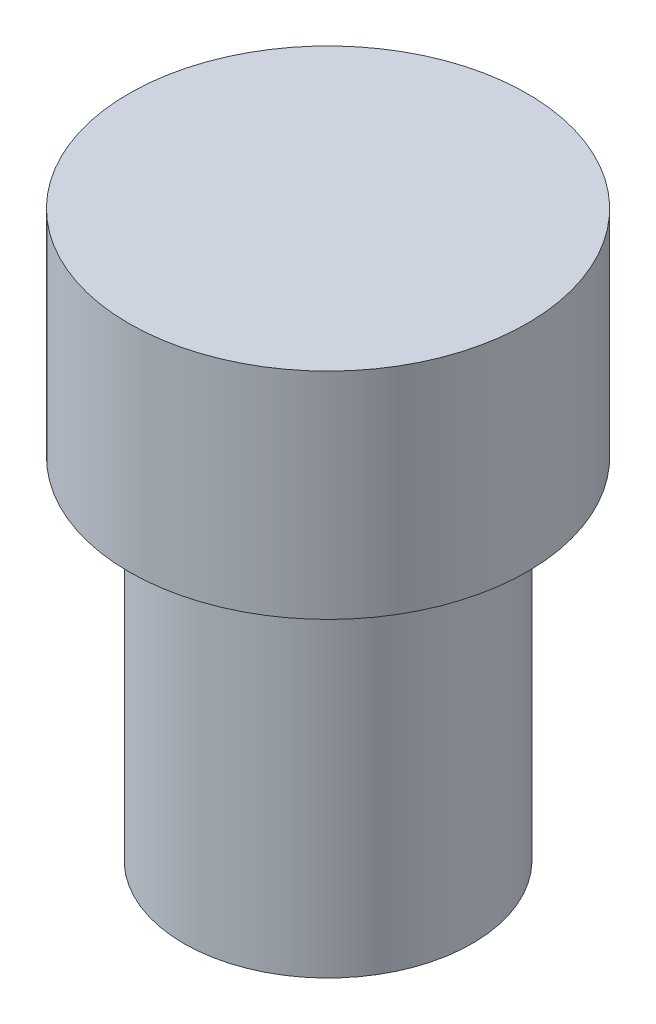
ISO-10303-21;
HEADER;
FILE_DESCRIPTION(('STEP AP214'),'2;1');
FILE_NAME('part.step','',(''),(''),'','','');
FILE_SCHEMA(('AUTOMOTIVE_DESIGN { 1 0 10303 214 1 1 1 1 }'));
ENDSEC;
DATA;
#1=APPLICATION_CONTEXT('core data for automotive mechanical design processes');
#2=APPLICATION_PROTOCOL_DEFINITION('international standard','automotive_design',2000,#1);
#3=PRODUCT_CONTEXT('',#1,'mechanical');
#4=PRODUCT('Part','Part','',(#3));
#5=PRODUCT_RELATED_PRODUCT_CATEGORY('part','',(#4));
#6=PRODUCT_DEFINITION_FORMATION('','',#4);
#7=PRODUCT_DEFINITION_CONTEXT('part definition',#1,'design');
#8=PRODUCT_DEFINITION('design','',#6,#7);
#9=PRODUCT_DEFINITION_SHAPE('','',#8);
#10=(LENGTH_UNIT() NAMED_UNIT(*) SI_UNIT(.MILLI.,.METRE.));
#11=(NAMED_UNIT(*) PLANE_ANGLE_UNIT() SI_UNIT($,.RADIAN.));
#12=(NAMED_UNIT(*) SI_UNIT($,.STERADIAN.) SOLID_ANGLE_UNIT());
#13=UNCERTAINTY_MEASURE_WITH_UNIT(LENGTH_MEASURE(1.E-05),#10,'distance_accuracy_value','');
#14=(GEOMETRIC_REPRESENTATION_CONTEXT(3) GLOBAL_UNCERTAINTY_ASSIGNED_CONTEXT((#13)) GLOBAL_UNIT_ASSIGNED_CONTEXT((#10,
#11,#12)) REPRESENTATION_CONTEXT('',''));
#15=CARTESIAN_POINT('',(0.,0.,0.));
#16=DIRECTION('',(0.,0.,1.));
#17=DIRECTION('',(1.,0.,0.));
#18=AXIS2_PLACEMENT_3D('',#15,#16,#17);
#19=CARTESIAN_POINT('',(0.,78.,0.));
#20=DIRECTION('',(0.,-1.,0.));
#21=DIRECTION('',(0.,0.,-1.));
#22=AXIS2_PLACEMENT_3D('',#19,#20,#21);
#23=CYLINDRICAL_SURFACE('',#22,32.1849383182023);
#24=CARTESIAN_POINT('',(0.,78.,0.));
#25=DIRECTION('',(0.,1.,0.));
#26=DIRECTION('',(0.,0.,1.));
#27=AXIS2_PLACEMENT_3D('',#24,#25,#26);
#28=CIRCLE('',#27,32.1849383182023);
#29=CARTESIAN_POINT('',(0.,78.,32.1849383182023));
#30=VERTEX_POINT('',#29);
#31=EDGE_CURVE('E10',#30,#30,#28,.T.);
#32=ORIENTED_EDGE('',*,*,#31,.F.);
#33=EDGE_LOOP('',(#32));
#34=FACE_BOUND('',#33,.T.);
#35=CARTESIAN_POINT('',(0.,0.,0.));
#36=DIRECTION('',(0.,1.,0.));
#37=DIRECTION('',(0.,0.,1.));
#38=AXIS2_PLACEMENT_3D('',#35,#36,#37);
#39=CIRCLE('',#38,32.1849383182023);
#40=CARTESIAN_POINT('',(0.,0.,32.1849383182023));
#41=VERTEX_POINT('',#40);
#42=EDGE_CURVE('E36',#41,#41,#39,.T.);
#43=ORIENTED_EDGE('',*,*,#42,.T.);
#44=EDGE_LOOP('',(#43));
#45=FACE_BOUND('',#44,.T.);
#46=ADVANCED_FACE('F33',(#34,#45),#23,.T.);
#47=CARTESIAN_POINT('',(0.,0.,0.));
#48=DIRECTION('',(0.,1.,0.));
#49=DIRECTION('',(0.,0.,1.));
#50=AXIS2_PLACEMENT_3D('',#47,#48,#49);
#51=PLANE('',#50);
#52=ORIENTED_EDGE('',*,*,#42,.F.);
#53=EDGE_LOOP('',(#52));
#54=FACE_BOUND('',#53,.T.);
#55=ADVANCED_FACE('F56',(#54),#51,.F.);
#56=CARTESIAN_POINT('',(0.,126.,0.));
#57=DIRECTION('',(0.,-1.,0.));
#58=DIRECTION('',(0.,0.,-1.));
#59=AXIS2_PLACEMENT_3D('',#56,#57,#58);
#60=CYLINDRICAL_SURFACE('',#59,44.4527610749906);
#61=CARTESIAN_POINT('',(0.,126.,0.));
#62=DIRECTION('',(0.,1.,0.));
#63=DIRECTION('',(0.,0.,1.));
#64=AXIS2_PLACEMENT_3D('',#61,#62,#63);
#65=CIRCLE('',#64,44.4527610749906);
#66=CARTESIAN_POINT('',(0.,126.,44.4527610749906));
#67=VERTEX_POINT('',#66);
#68=EDGE_CURVE('E43',#67,#67,#65,.T.);
#69=ORIENTED_EDGE('',*,*,#68,.F.);
#70=EDGE_LOOP('',(#69));
#71=FACE_BOUND('',#70,.T.);
#72=CARTESIAN_POINT('',(0.,78.,0.));
#73=DIRECTION('',(0.,1.,0.));
#74=DIRECTION('',(0.,0.,1.));
#75=AXIS2_PLACEMENT_3D('',#72,#73,#74);
#76=CIRCLE('',#75,44.4527610749906);
#77=CARTESIAN_POINT('',(0.,78.,44.4527610749906));
#78=VERTEX_POINT('',#77);
#79=EDGE_CURVE('E45',#78,#78,#76,.T.);
#80=ORIENTED_EDGE('',*,*,#79,.T.);
#81=EDGE_LOOP('',(#80));
#82=FACE_BOUND('',#81,.T.);
#83=ADVANCED_FACE('F53',(#71,#82),#60,.T.);
#84=CARTESIAN_POINT('',(0.,126.,0.));
#85=DIRECTION('',(0.,1.,0.));
#86=DIRECTION('',(0.,0.,1.));
#87=AXIS2_PLACEMENT_3D('',#84,#85,#86);
#88=PLANE('',#87);
#89=ORIENTED_EDGE('',*,*,#68,.T.);
#90=EDGE_LOOP('',(#89));
#91=FACE_BOUND('',#90,.T.);
#92=ADVANCED_FACE('F51',(#91),#88,.T.);
#93=CARTESIAN_POINT('',(0.,78.,0.));
#94=DIRECTION('',(0.,1.,0.));
#95=DIRECTION('',(0.,0.,1.));
#96=AXIS2_PLACEMENT_3D('',#93,#94,#95);
#97=PLANE('',#96);
#98=ORIENTED_EDGE('',*,*,#31,.T.);
#99=EDGE_LOOP('',(#98));
#100=FACE_BOUND('',#99,.T.);
#101=ORIENTED_EDGE('',*,*,#79,.F.);
#102=EDGE_LOOP('',(#101));
#103=FACE_BOUND('',#102,.T.);
#104=ADVANCED_FACE('F60',(#100,#103),#97,.F.);
#105=CLOSED_SHELL('',(#46,#55,#83,#92,#104));
#106=MANIFOLD_SOLID_BREP('B2',#105);
#107=ADVANCED_BREP_SHAPE_REPRESENTATION('',(#18,#106),#14);
#108=SHAPE_DEFINITION_REPRESENTATION(#9,#107);
ENDSEC;
END-ISO-10303-21;
